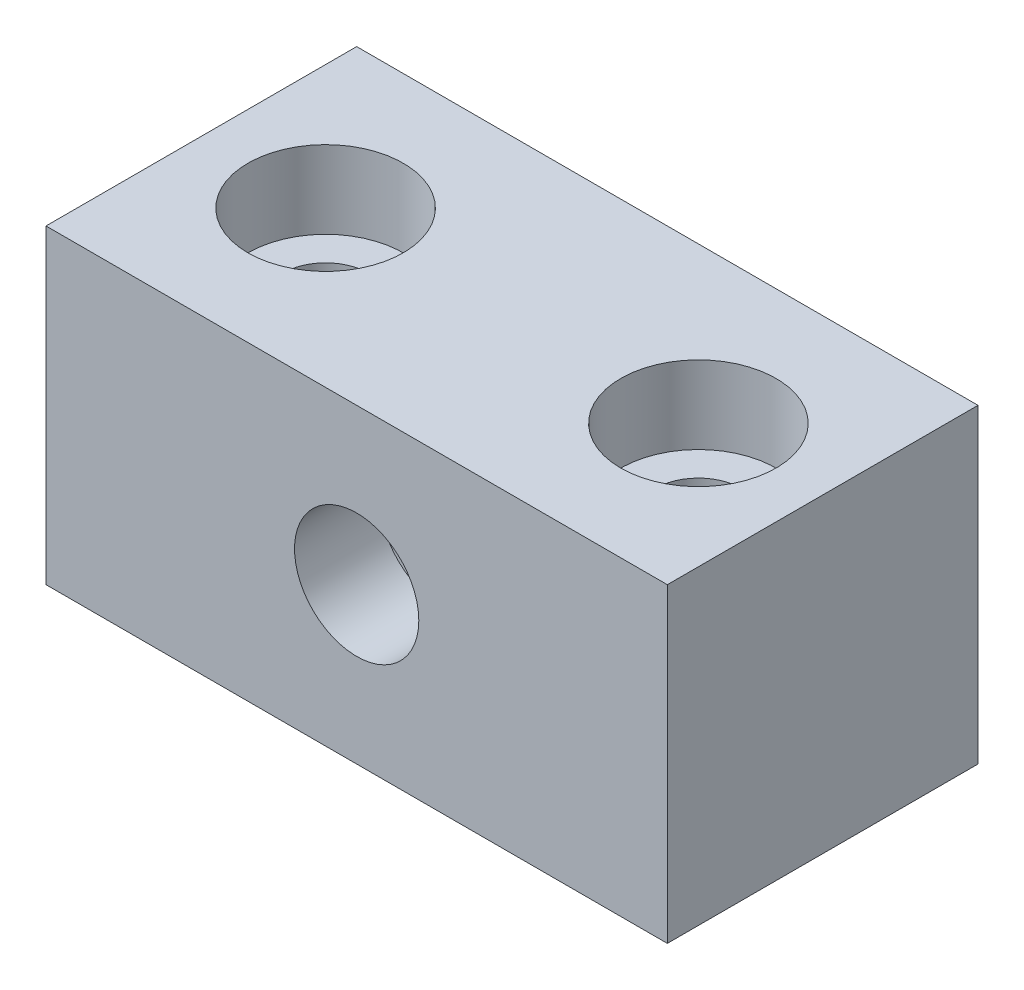
ISO-10303-21;
HEADER;
FILE_DESCRIPTION(('STEP AP214'),'2;1');
FILE_NAME('part.step','',(''),(''),'','','');
FILE_SCHEMA(('AUTOMOTIVE_DESIGN { 1 0 10303 214 1 1 1 1 }'));
ENDSEC;
DATA;
#1=APPLICATION_CONTEXT('core data for automotive mechanical design processes');
#2=APPLICATION_PROTOCOL_DEFINITION('international standard','automotive_design',2000,#1);
#3=PRODUCT_CONTEXT('',#1,'mechanical');
#4=PRODUCT('Part','Part','',(#3));
#5=PRODUCT_RELATED_PRODUCT_CATEGORY('part','',(#4));
#6=PRODUCT_DEFINITION_FORMATION('','',#4);
#7=PRODUCT_DEFINITION_CONTEXT('part definition',#1,'design');
#8=PRODUCT_DEFINITION('design','',#6,#7);
#9=PRODUCT_DEFINITION_SHAPE('','',#8);
#10=(LENGTH_UNIT() NAMED_UNIT(*) SI_UNIT(.MILLI.,.METRE.));
#11=(NAMED_UNIT(*) PLANE_ANGLE_UNIT() SI_UNIT($,.RADIAN.));
#12=(NAMED_UNIT(*) SI_UNIT($,.STERADIAN.) SOLID_ANGLE_UNIT());
#13=UNCERTAINTY_MEASURE_WITH_UNIT(LENGTH_MEASURE(1.E-05),#10,'distance_accuracy_value','');
#14=(GEOMETRIC_REPRESENTATION_CONTEXT(3) GLOBAL_UNCERTAINTY_ASSIGNED_CONTEXT((#13)) GLOBAL_UNIT_ASSIGNED_CONTEXT((#10,
#11,#12)) REPRESENTATION_CONTEXT('',''));
#15=CARTESIAN_POINT('',(0.,0.,0.));
#16=DIRECTION('',(0.,0.,1.));
#17=DIRECTION('',(1.,0.,0.));
#18=AXIS2_PLACEMENT_3D('',#15,#16,#17);
#19=CARTESIAN_POINT('',(32.,0.,10.));
#20=DIRECTION('',(0.,1.,0.));
#21=DIRECTION('',(0.,0.,1.));
#22=AXIS2_PLACEMENT_3D('',#19,#20,#21);
#23=CYLINDRICAL_SURFACE('',#22,2.75);
#24=CARTESIAN_POINT('',(32.,0.,10.));
#25=DIRECTION('',(0.,1.,0.));
#26=DIRECTION('',(0.,0.,1.));
#27=AXIS2_PLACEMENT_3D('',#24,#25,#26);
#28=CIRCLE('',#27,2.75);
#29=CARTESIAN_POINT('',(32.,0.,12.75));
#30=VERTEX_POINT('',#29);
#31=EDGE_CURVE('E111',#30,#30,#28,.T.);
#32=ORIENTED_EDGE('',*,*,#31,.F.);
#33=EDGE_LOOP('',(#32));
#34=FACE_BOUND('',#33,.T.);
#35=CARTESIAN_POINT('',(32.,15.,10.));
#36=DIRECTION('',(0.,1.,0.));
#37=DIRECTION('',(0.,0.,1.));
#38=AXIS2_PLACEMENT_3D('',#35,#36,#37);
#39=CIRCLE('',#38,2.75);
#40=CARTESIAN_POINT('',(32.,15.,12.75));
#41=VERTEX_POINT('',#40);
#42=EDGE_CURVE('E113',#41,#41,#39,.F.);
#43=ORIENTED_EDGE('',*,*,#42,.F.);
#44=EDGE_LOOP('',(#43));
#45=FACE_BOUND('',#44,.T.);
#46=ADVANCED_FACE('F33',(#34,#45),#23,.F.);
#47=CARTESIAN_POINT('',(8.,0.,10.));
#48=DIRECTION('',(0.,1.,0.));
#49=DIRECTION('',(0.,0.,1.));
#50=AXIS2_PLACEMENT_3D('',#47,#48,#49);
#51=CYLINDRICAL_SURFACE('',#50,2.75);
#52=CARTESIAN_POINT('',(8.,0.,10.));
#53=DIRECTION('',(0.,1.,0.));
#54=DIRECTION('',(0.,0.,1.));
#55=AXIS2_PLACEMENT_3D('',#52,#53,#54);
#56=CIRCLE('',#55,2.75);
#57=CARTESIAN_POINT('',(8.,0.,12.75));
#58=VERTEX_POINT('',#57);
#59=EDGE_CURVE('E103',#58,#58,#56,.T.);
#60=ORIENTED_EDGE('',*,*,#59,.F.);
#61=EDGE_LOOP('',(#60));
#62=FACE_BOUND('',#61,.T.);
#63=CARTESIAN_POINT('',(8.,15.,10.));
#64=DIRECTION('',(0.,1.,0.));
#65=DIRECTION('',(0.,0.,1.));
#66=AXIS2_PLACEMENT_3D('',#63,#64,#65);
#67=CIRCLE('',#66,2.75);
#68=CARTESIAN_POINT('',(8.,15.,12.75));
#69=VERTEX_POINT('',#68);
#70=EDGE_CURVE('E109',#69,#69,#67,.F.);
#71=ORIENTED_EDGE('',*,*,#70,.F.);
#72=EDGE_LOOP('',(#71));
#73=FACE_BOUND('',#72,.T.);
#74=ADVANCED_FACE('F141',(#62,#73),#51,.F.);
#75=CARTESIAN_POINT('',(0.,0.,20.));
#76=DIRECTION('',(1.,0.,0.));
#77=DIRECTION('',(0.,0.,-1.));
#78=AXIS2_PLACEMENT_3D('',#75,#76,#77);
#79=PLANE('',#78);
#80=DIRECTION('',(0.,-1.,0.));
#81=VECTOR('',#80,1.);
#82=CARTESIAN_POINT('',(0.,0.,0.));
#83=LINE('',#82,#81);
#84=CARTESIAN_POINT('',(0.,20.,0.));
#85=VERTEX_POINT('',#84);
#86=CARTESIAN_POINT('',(0.,0.,0.));
#87=VERTEX_POINT('',#86);
#88=EDGE_CURVE('E100',#85,#87,#83,.T.);
#89=ORIENTED_EDGE('',*,*,#88,.T.);
#90=DIRECTION('',(0.,0.,-1.));
#91=VECTOR('',#90,1.);
#92=CARTESIAN_POINT('',(0.,0.,20.));
#93=LINE('',#92,#91);
#94=CARTESIAN_POINT('',(0.,0.,20.));
#95=VERTEX_POINT('',#94);
#96=EDGE_CURVE('E11',#95,#87,#93,.T.);
#97=ORIENTED_EDGE('',*,*,#96,.F.);
#98=DIRECTION('',(0.,-1.,0.));
#99=VECTOR('',#98,1.);
#100=CARTESIAN_POINT('',(0.,0.,20.));
#101=LINE('',#100,#99);
#102=CARTESIAN_POINT('',(0.,20.,20.));
#103=VERTEX_POINT('',#102);
#104=EDGE_CURVE('E87',#103,#95,#101,.T.);
#105=ORIENTED_EDGE('',*,*,#104,.F.);
#106=DIRECTION('',(0.,0.,-1.));
#107=VECTOR('',#106,1.);
#108=CARTESIAN_POINT('',(0.,20.,20.));
#109=LINE('',#108,#107);
#110=EDGE_CURVE('E96',#103,#85,#109,.T.);
#111=ORIENTED_EDGE('',*,*,#110,.T.);
#112=EDGE_LOOP('',(#89,#97,#105,#111));
#113=FACE_BOUND('',#112,.T.);
#114=ADVANCED_FACE('F35',(#113),#79,.F.);
#115=CARTESIAN_POINT('',(0.,0.,20.));
#116=DIRECTION('',(0.,1.,0.));
#117=DIRECTION('',(0.,0.,1.));
#118=AXIS2_PLACEMENT_3D('',#115,#116,#117);
#119=PLANE('',#118);
#120=ORIENTED_EDGE('',*,*,#31,.T.);
#121=EDGE_LOOP('',(#120));
#122=FACE_BOUND('',#121,.T.);
#123=ORIENTED_EDGE('',*,*,#59,.T.);
#124=EDGE_LOOP('',(#123));
#125=FACE_BOUND('',#124,.T.);
#126=DIRECTION('',(1.,0.,0.));
#127=VECTOR('',#126,1.);
#128=CARTESIAN_POINT('',(0.,0.,0.));
#129=LINE('',#128,#127);
#130=CARTESIAN_POINT('',(40.,0.,0.));
#131=VERTEX_POINT('',#130);
#132=EDGE_CURVE('E91',#87,#131,#129,.T.);
#133=ORIENTED_EDGE('',*,*,#132,.T.);
#134=DIRECTION('',(0.,0.,-1.));
#135=VECTOR('',#134,1.);
#136=CARTESIAN_POINT('',(40.,0.,20.));
#137=LINE('',#136,#135);
#138=CARTESIAN_POINT('',(40.,0.,20.));
#139=VERTEX_POINT('',#138);
#140=EDGE_CURVE('E43',#139,#131,#137,.T.);
#141=ORIENTED_EDGE('',*,*,#140,.F.);
#142=DIRECTION('',(1.,0.,0.));
#143=VECTOR('',#142,1.);
#144=CARTESIAN_POINT('',(0.,0.,20.));
#145=LINE('',#144,#143);
#146=EDGE_CURVE('E82',#95,#139,#145,.T.);
#147=ORIENTED_EDGE('',*,*,#146,.F.);
#148=ORIENTED_EDGE('',*,*,#96,.T.);
#149=EDGE_LOOP('',(#133,#141,#147,#148));
#150=FACE_BOUND('',#149,.T.);
#151=ADVANCED_FACE('F90',(#122,#125,#150),#119,.F.);
#152=CARTESIAN_POINT('',(40.,0.,20.));
#153=DIRECTION('',(-1.,0.,0.));
#154=DIRECTION('',(0.,0.,1.));
#155=AXIS2_PLACEMENT_3D('',#152,#153,#154);
#156=PLANE('',#155);
#157=DIRECTION('',(0.,1.,0.));
#158=VECTOR('',#157,1.);
#159=CARTESIAN_POINT('',(40.,0.,0.));
#160=LINE('',#159,#158);
#161=CARTESIAN_POINT('',(40.,20.,0.));
#162=VERTEX_POINT('',#161);
#163=EDGE_CURVE('E69',#131,#162,#160,.T.);
#164=ORIENTED_EDGE('',*,*,#163,.T.);
#165=DIRECTION('',(0.,0.,-1.));
#166=VECTOR('',#165,1.);
#167=CARTESIAN_POINT('',(40.,20.,20.));
#168=LINE('',#167,#166);
#169=CARTESIAN_POINT('',(40.,20.,20.));
#170=VERTEX_POINT('',#169);
#171=EDGE_CURVE('E92',#170,#162,#168,.T.);
#172=ORIENTED_EDGE('',*,*,#171,.F.);
#173=DIRECTION('',(0.,1.,0.));
#174=VECTOR('',#173,1.);
#175=CARTESIAN_POINT('',(40.,0.,20.));
#176=LINE('',#175,#174);
#177=EDGE_CURVE('E85',#139,#170,#176,.T.);
#178=ORIENTED_EDGE('',*,*,#177,.F.);
#179=ORIENTED_EDGE('',*,*,#140,.T.);
#180=EDGE_LOOP('',(#164,#172,#178,#179));
#181=FACE_BOUND('',#180,.T.);
#182=ADVANCED_FACE('F94',(#181),#156,.F.);
#183=CARTESIAN_POINT('',(0.,20.,20.));
#184=DIRECTION('',(0.,-1.,0.));
#185=DIRECTION('',(0.,0.,-1.));
#186=AXIS2_PLACEMENT_3D('',#183,#184,#185);
#187=PLANE('',#186);
#188=CARTESIAN_POINT('',(32.,20.,10.));
#189=DIRECTION('',(0.,1.,0.));
#190=DIRECTION('',(0.,0.,1.));
#191=AXIS2_PLACEMENT_3D('',#188,#189,#190);
#192=CIRCLE('',#191,5.);
#193=CARTESIAN_POINT('',(32.,20.,15.));
#194=VERTEX_POINT('',#193);
#195=EDGE_CURVE('E122',#194,#194,#192,.T.);
#196=ORIENTED_EDGE('',*,*,#195,.F.);
#197=EDGE_LOOP('',(#196));
#198=FACE_BOUND('',#197,.T.);
#199=CARTESIAN_POINT('',(8.,20.,10.));
#200=DIRECTION('',(0.,1.,0.));
#201=DIRECTION('',(0.,0.,1.));
#202=AXIS2_PLACEMENT_3D('',#199,#200,#201);
#203=CIRCLE('',#202,5.);
#204=CARTESIAN_POINT('',(8.,20.,15.));
#205=VERTEX_POINT('',#204);
#206=EDGE_CURVE('E115',#205,#205,#203,.T.);
#207=ORIENTED_EDGE('',*,*,#206,.F.);
#208=EDGE_LOOP('',(#207));
#209=FACE_BOUND('',#208,.T.);
#210=DIRECTION('',(-1.,0.,0.));
#211=VECTOR('',#210,1.);
#212=CARTESIAN_POINT('',(0.,20.,0.));
#213=LINE('',#212,#211);
#214=EDGE_CURVE('E75',#162,#85,#213,.T.);
#215=ORIENTED_EDGE('',*,*,#214,.T.);
#216=ORIENTED_EDGE('',*,*,#110,.F.);
#217=DIRECTION('',(-1.,0.,0.));
#218=VECTOR('',#217,1.);
#219=CARTESIAN_POINT('',(0.,20.,20.));
#220=LINE('',#219,#218);
#221=EDGE_CURVE('E52',#170,#103,#220,.T.);
#222=ORIENTED_EDGE('',*,*,#221,.F.);
#223=ORIENTED_EDGE('',*,*,#171,.T.);
#224=EDGE_LOOP('',(#215,#216,#222,#223));
#225=FACE_BOUND('',#224,.T.);
#226=ADVANCED_FACE('F172',(#198,#209,#225),#187,.F.);
#227=CARTESIAN_POINT('',(0.,0.,20.));
#228=DIRECTION('',(0.,0.,-1.));
#229=DIRECTION('',(-1.,0.,0.));
#230=AXIS2_PLACEMENT_3D('',#227,#228,#229);
#231=PLANE('',#230);
#232=CARTESIAN_POINT('',(20.,10.,20.));
#233=DIRECTION('',(0.,0.,1.));
#234=DIRECTION('',(1.,0.,0.));
#235=AXIS2_PLACEMENT_3D('',#232,#233,#234);
#236=CIRCLE('',#235,4.);
#237=CARTESIAN_POINT('',(24.,10.,20.));
#238=VERTEX_POINT('',#237);
#239=EDGE_CURVE('E130',#238,#238,#236,.T.);
#240=ORIENTED_EDGE('',*,*,#239,.F.);
#241=EDGE_LOOP('',(#240));
#242=FACE_BOUND('',#241,.T.);
#243=ORIENTED_EDGE('',*,*,#104,.T.);
#244=ORIENTED_EDGE('',*,*,#146,.T.);
#245=ORIENTED_EDGE('',*,*,#177,.T.);
#246=ORIENTED_EDGE('',*,*,#221,.T.);
#247=EDGE_LOOP('',(#243,#244,#245,#246));
#248=FACE_BOUND('',#247,.T.);
#249=ADVANCED_FACE('F83',(#242,#248),#231,.F.);
#250=CARTESIAN_POINT('',(0.,0.,0.));
#251=DIRECTION('',(0.,0.,-1.));
#252=DIRECTION('',(-1.,0.,0.));
#253=AXIS2_PLACEMENT_3D('',#250,#251,#252);
#254=PLANE('',#253);
#255=CARTESIAN_POINT('',(20.,10.,0.));
#256=DIRECTION('',(0.,0.,-1.));
#257=DIRECTION('',(-1.,0.,0.));
#258=AXIS2_PLACEMENT_3D('',#255,#256,#257);
#259=CIRCLE('',#258,4.);
#260=CARTESIAN_POINT('',(16.,10.,0.));
#261=VERTEX_POINT('',#260);
#262=EDGE_CURVE('E303',#261,#261,#259,.T.);
#263=ORIENTED_EDGE('',*,*,#262,.F.);
#264=EDGE_LOOP('',(#263));
#265=FACE_BOUND('',#264,.T.);
#266=ORIENTED_EDGE('',*,*,#88,.F.);
#267=ORIENTED_EDGE('',*,*,#214,.F.);
#268=ORIENTED_EDGE('',*,*,#163,.F.);
#269=ORIENTED_EDGE('',*,*,#132,.F.);
#270=EDGE_LOOP('',(#266,#267,#268,#269));
#271=FACE_BOUND('',#270,.T.);
#272=ADVANCED_FACE('F150',(#265,#271),#254,.T.);
#273=CARTESIAN_POINT('',(8.,15.,10.));
#274=DIRECTION('',(0.,1.,0.));
#275=DIRECTION('',(0.,0.,1.));
#276=AXIS2_PLACEMENT_3D('',#273,#274,#275);
#277=PLANE('',#276);
#278=CARTESIAN_POINT('',(8.,15.,10.));
#279=DIRECTION('',(0.,1.,0.));
#280=DIRECTION('',(0.,0.,1.));
#281=AXIS2_PLACEMENT_3D('',#278,#279,#280);
#282=CIRCLE('',#281,5.);
#283=CARTESIAN_POINT('',(8.,15.,15.));
#284=VERTEX_POINT('',#283);
#285=EDGE_CURVE('E112',#284,#284,#282,.T.);
#286=ORIENTED_EDGE('',*,*,#285,.T.);
#287=EDGE_LOOP('',(#286));
#288=FACE_BOUND('',#287,.T.);
#289=ORIENTED_EDGE('',*,*,#70,.T.);
#290=EDGE_LOOP('',(#289));
#291=FACE_BOUND('',#290,.T.);
#292=ADVANCED_FACE('F147',(#288,#291),#277,.T.);
#293=CARTESIAN_POINT('',(8.,15.,10.));
#294=DIRECTION('',(0.,1.,0.));
#295=DIRECTION('',(0.,0.,1.));
#296=AXIS2_PLACEMENT_3D('',#293,#294,#295);
#297=CYLINDRICAL_SURFACE('',#296,5.);
#298=ORIENTED_EDGE('',*,*,#285,.F.);
#299=EDGE_LOOP('',(#298));
#300=FACE_BOUND('',#299,.T.);
#301=ORIENTED_EDGE('',*,*,#206,.T.);
#302=EDGE_LOOP('',(#301));
#303=FACE_BOUND('',#302,.T.);
#304=ADVANCED_FACE('F149',(#300,#303),#297,.F.);
#305=CARTESIAN_POINT('',(32.,15.,10.));
#306=DIRECTION('',(0.,1.,0.));
#307=DIRECTION('',(0.,0.,1.));
#308=AXIS2_PLACEMENT_3D('',#305,#306,#307);
#309=PLANE('',#308);
#310=CARTESIAN_POINT('',(32.,15.,10.));
#311=DIRECTION('',(0.,1.,0.));
#312=DIRECTION('',(0.,0.,1.));
#313=AXIS2_PLACEMENT_3D('',#310,#311,#312);
#314=CIRCLE('',#313,5.);
#315=CARTESIAN_POINT('',(32.,15.,15.));
#316=VERTEX_POINT('',#315);
#317=EDGE_CURVE('E116',#316,#316,#314,.T.);
#318=ORIENTED_EDGE('',*,*,#317,.T.);
#319=EDGE_LOOP('',(#318));
#320=FACE_BOUND('',#319,.T.);
#321=ORIENTED_EDGE('',*,*,#42,.T.);
#322=EDGE_LOOP('',(#321));
#323=FACE_BOUND('',#322,.T.);
#324=ADVANCED_FACE('F157',(#320,#323),#309,.T.);
#325=CARTESIAN_POINT('',(32.,15.,10.));
#326=DIRECTION('',(0.,1.,0.));
#327=DIRECTION('',(0.,0.,1.));
#328=AXIS2_PLACEMENT_3D('',#325,#326,#327);
#329=CYLINDRICAL_SURFACE('',#328,5.);
#330=ORIENTED_EDGE('',*,*,#317,.F.);
#331=EDGE_LOOP('',(#330));
#332=FACE_BOUND('',#331,.T.);
#333=ORIENTED_EDGE('',*,*,#195,.T.);
#334=EDGE_LOOP('',(#333));
#335=FACE_BOUND('',#334,.T.);
#336=ADVANCED_FACE('F224',(#332,#335),#329,.F.);
#337=CARTESIAN_POINT('',(20.,10.,14.5));
#338=DIRECTION('',(0.,0.,1.));
#339=DIRECTION('',(1.,0.,0.));
#340=AXIS2_PLACEMENT_3D('',#337,#338,#339);
#341=CYLINDRICAL_SURFACE('',#340,4.);
#342=CARTESIAN_POINT('',(20.,10.,14.5));
#343=DIRECTION('',(0.,0.,1.));
#344=DIRECTION('',(1.,0.,0.));
#345=AXIS2_PLACEMENT_3D('',#342,#343,#344);
#346=CIRCLE('',#345,4.);
#347=CARTESIAN_POINT('',(24.,10.,14.5));
#348=VERTEX_POINT('',#347);
#349=EDGE_CURVE('E127',#348,#348,#346,.T.);
#350=ORIENTED_EDGE('',*,*,#349,.F.);
#351=EDGE_LOOP('',(#350));
#352=FACE_BOUND('',#351,.T.);
#353=ORIENTED_EDGE('',*,*,#239,.T.);
#354=EDGE_LOOP('',(#353));
#355=FACE_BOUND('',#354,.T.);
#356=ADVANCED_FACE('F233',(#352,#355),#341,.F.);
#357=CARTESIAN_POINT('',(20.,10.,14.5));
#358=DIRECTION('',(0.,0.,1.));
#359=DIRECTION('',(1.,0.,0.));
#360=AXIS2_PLACEMENT_3D('',#357,#358,#359);
#361=PLANE('',#360);
#362=CARTESIAN_POINT('',(20.,10.,14.5));
#363=DIRECTION('',(0.,0.,1.));
#364=DIRECTION('',(1.,0.,0.));
#365=AXIS2_PLACEMENT_3D('',#362,#363,#364);
#366=CIRCLE('',#365,3.5);
#367=CARTESIAN_POINT('',(23.5,10.,14.5));
#368=VERTEX_POINT('',#367);
#369=EDGE_CURVE('E301',#368,#368,#366,.T.);
#370=ORIENTED_EDGE('',*,*,#369,.F.);
#371=EDGE_LOOP('',(#370));
#372=FACE_BOUND('',#371,.T.);
#373=ORIENTED_EDGE('',*,*,#349,.T.);
#374=EDGE_LOOP('',(#373));
#375=FACE_BOUND('',#374,.T.);
#376=ADVANCED_FACE('F247',(#372,#375),#361,.T.);
#377=CARTESIAN_POINT('',(20.,10.,5.5));
#378=DIRECTION('',(0.,0.,-1.));
#379=DIRECTION('',(-1.,0.,0.));
#380=AXIS2_PLACEMENT_3D('',#377,#378,#379);
#381=CYLINDRICAL_SURFACE('',#380,4.);
#382=CARTESIAN_POINT('',(20.,10.,5.5));
#383=DIRECTION('',(0.,0.,-1.));
#384=DIRECTION('',(-1.,0.,0.));
#385=AXIS2_PLACEMENT_3D('',#382,#383,#384);
#386=CIRCLE('',#385,4.);
#387=CARTESIAN_POINT('',(16.,10.,5.5));
#388=VERTEX_POINT('',#387);
#389=EDGE_CURVE('E305',#388,#388,#386,.T.);
#390=ORIENTED_EDGE('',*,*,#389,.F.);
#391=EDGE_LOOP('',(#390));
#392=FACE_BOUND('',#391,.T.);
#393=ORIENTED_EDGE('',*,*,#262,.T.);
#394=EDGE_LOOP('',(#393));
#395=FACE_BOUND('',#394,.T.);
#396=ADVANCED_FACE('F260',(#392,#395),#381,.F.);
#397=CARTESIAN_POINT('',(20.,10.,5.5));
#398=DIRECTION('',(0.,0.,-1.));
#399=DIRECTION('',(-1.,0.,0.));
#400=AXIS2_PLACEMENT_3D('',#397,#398,#399);
#401=PLANE('',#400);
#402=CARTESIAN_POINT('',(20.,10.,5.5));
#403=DIRECTION('',(0.,0.,-1.));
#404=DIRECTION('',(-1.,0.,0.));
#405=AXIS2_PLACEMENT_3D('',#402,#403,#404);
#406=CIRCLE('',#405,3.5);
#407=CARTESIAN_POINT('',(16.5,10.,5.5));
#408=VERTEX_POINT('',#407);
#409=EDGE_CURVE('E37',#408,#408,#406,.T.);
#410=ORIENTED_EDGE('',*,*,#409,.F.);
#411=EDGE_LOOP('',(#410));
#412=FACE_BOUND('',#411,.T.);
#413=ORIENTED_EDGE('',*,*,#389,.T.);
#414=EDGE_LOOP('',(#413));
#415=FACE_BOUND('',#414,.T.);
#416=ADVANCED_FACE('F265',(#412,#415),#401,.T.);
#417=CARTESIAN_POINT('',(20.,10.,0.));
#418=DIRECTION('',(0.,0.,1.));
#419=DIRECTION('',(1.,0.,0.));
#420=AXIS2_PLACEMENT_3D('',#417,#418,#419);
#421=CYLINDRICAL_SURFACE('',#420,3.5);
#422=ORIENTED_EDGE('',*,*,#409,.T.);
#423=EDGE_LOOP('',(#422));
#424=FACE_BOUND('',#423,.T.);
#425=ORIENTED_EDGE('',*,*,#369,.T.);
#426=EDGE_LOOP('',(#425));
#427=FACE_BOUND('',#426,.T.);
#428=ADVANCED_FACE('F282',(#424,#427),#421,.F.);
#429=CLOSED_SHELL('',(#46,#74,#114,#151,#182,#226,#249,#272,#292,#304,#324,#336,#356,#376,#396,
#416,#428));
#430=MANIFOLD_SOLID_BREP('B2',#429);
#431=ADVANCED_BREP_SHAPE_REPRESENTATION('',(#18,#430),#14);
#432=SHAPE_DEFINITION_REPRESENTATION(#9,#431);
ENDSEC;
END-ISO-10303-21;
